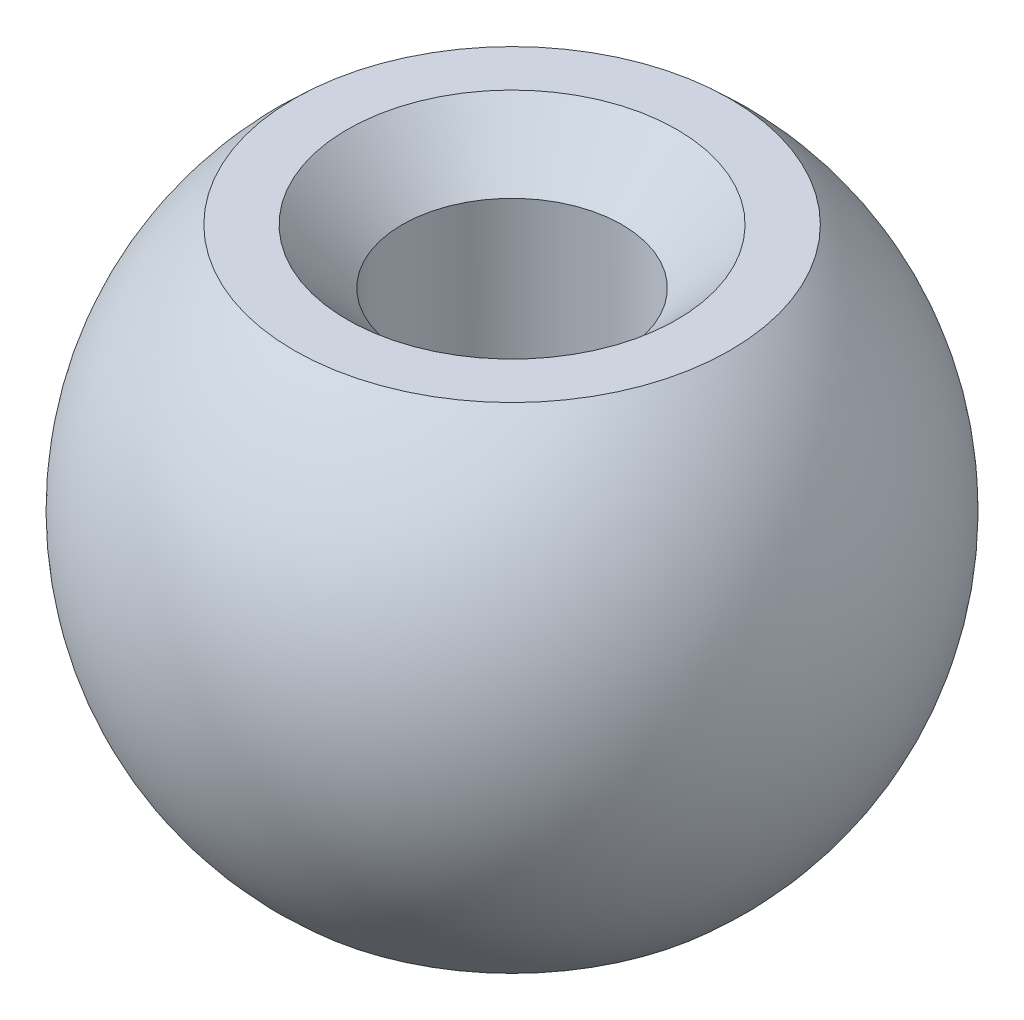
ISO-10303-21;
HEADER;
FILE_DESCRIPTION(('STEP AP214'),'2;1');
FILE_NAME('part.step','',(''),(''),'','','');
FILE_SCHEMA(('AUTOMOTIVE_DESIGN { 1 0 10303 214 1 1 1 1 }'));
ENDSEC;
DATA;
#1=APPLICATION_CONTEXT('core data for automotive mechanical design processes');
#2=APPLICATION_PROTOCOL_DEFINITION('international standard','automotive_design',2000,#1);
#3=PRODUCT_CONTEXT('',#1,'mechanical');
#4=PRODUCT('Part','Part','',(#3));
#5=PRODUCT_RELATED_PRODUCT_CATEGORY('part','',(#4));
#6=PRODUCT_DEFINITION_FORMATION('','',#4);
#7=PRODUCT_DEFINITION_CONTEXT('part definition',#1,'design');
#8=PRODUCT_DEFINITION('design','',#6,#7);
#9=PRODUCT_DEFINITION_SHAPE('','',#8);
#10=(LENGTH_UNIT() NAMED_UNIT(*) SI_UNIT(.MILLI.,.METRE.));
#11=(NAMED_UNIT(*) PLANE_ANGLE_UNIT() SI_UNIT($,.RADIAN.));
#12=(NAMED_UNIT(*) SI_UNIT($,.STERADIAN.) SOLID_ANGLE_UNIT());
#13=UNCERTAINTY_MEASURE_WITH_UNIT(LENGTH_MEASURE(1.E-05),#10,'distance_accuracy_value','');
#14=(GEOMETRIC_REPRESENTATION_CONTEXT(3) GLOBAL_UNCERTAINTY_ASSIGNED_CONTEXT((#13)) GLOBAL_UNIT_ASSIGNED_CONTEXT((#10,
#11,#12)) REPRESENTATION_CONTEXT('',''));
#15=CARTESIAN_POINT('',(0.,0.,0.));
#16=DIRECTION('',(0.,0.,1.));
#17=DIRECTION('',(1.,0.,0.));
#18=AXIS2_PLACEMENT_3D('',#15,#16,#17);
#19=CARTESIAN_POINT('',(2.,4.5,0.));
#20=DIRECTION('',(0.,-1.,0.));
#21=DIRECTION('',(0.,0.,-1.));
#22=AXIS2_PLACEMENT_3D('',#19,#20,#21);
#23=PLANE('',#22);
#24=CARTESIAN_POINT('',(0.,4.5,0.));
#25=DIRECTION('',(0.,-1.,0.));
#26=DIRECTION('',(0.,0.,-1.));
#27=AXIS2_PLACEMENT_3D('',#24,#25,#26);
#28=CIRCLE('',#27,3.);
#29=CARTESIAN_POINT('',(0.,4.5,-3.));
#30=VERTEX_POINT('',#29);
#31=EDGE_CURVE('E12',#30,#30,#28,.T.);
#32=ORIENTED_EDGE('',*,*,#31,.T.);
#33=EDGE_LOOP('',(#32));
#34=FACE_BOUND('',#33,.T.);
#35=CARTESIAN_POINT('',(0.,4.5,0.));
#36=DIRECTION('',(0.,1.,0.));
#37=DIRECTION('',(0.,0.,1.));
#38=AXIS2_PLACEMENT_3D('',#35,#36,#37);
#39=CIRCLE('',#38,3.96862696659689);
#40=CARTESIAN_POINT('',(0.,4.5,3.96862696659689));
#41=VERTEX_POINT('',#40);
#42=EDGE_CURVE('E62',#41,#41,#39,.T.);
#43=ORIENTED_EDGE('',*,*,#42,.T.);
#44=EDGE_LOOP('',(#43));
#45=FACE_BOUND('',#44,.T.);
#46=ADVANCED_FACE('F42',(#34,#45),#23,.F.);
#47=CARTESIAN_POINT('',(0.,5.53448264102485,0.));
#48=DIRECTION('',(0.,1.,0.));
#49=DIRECTION('',(0.,0.,1.));
#50=AXIS2_PLACEMENT_3D('',#47,#48,#49);
#51=CYLINDRICAL_SURFACE('',#50,2.);
#52=CARTESIAN_POINT('',(0.,3.5,0.));
#53=DIRECTION('',(0.,-1.,0.));
#54=DIRECTION('',(0.,0.,-1.));
#55=AXIS2_PLACEMENT_3D('',#52,#53,#54);
#56=CIRCLE('',#55,2.);
#57=CARTESIAN_POINT('',(0.,3.5,-2.));
#58=VERTEX_POINT('',#57);
#59=EDGE_CURVE('E49',#58,#58,#56,.F.);
#60=ORIENTED_EDGE('',*,*,#59,.T.);
#61=EDGE_LOOP('',(#60));
#62=FACE_BOUND('',#61,.T.);
#63=CARTESIAN_POINT('',(0.,-4.5,0.));
#64=DIRECTION('',(0.,1.,0.));
#65=DIRECTION('',(0.,0.,1.));
#66=AXIS2_PLACEMENT_3D('',#63,#64,#65);
#67=CIRCLE('',#66,2.);
#68=CARTESIAN_POINT('',(0.,-4.5,2.));
#69=VERTEX_POINT('',#68);
#70=EDGE_CURVE('E53',#69,#69,#67,.T.);
#71=ORIENTED_EDGE('',*,*,#70,.F.);
#72=EDGE_LOOP('',(#71));
#73=FACE_BOUND('',#72,.T.);
#74=ADVANCED_FACE('F76',(#62,#73),#51,.F.);
#75=CARTESIAN_POINT('',(2.,-4.5,0.));
#76=DIRECTION('',(0.,1.,0.));
#77=DIRECTION('',(0.,0.,1.));
#78=AXIS2_PLACEMENT_3D('',#75,#76,#77);
#79=PLANE('',#78);
#80=CARTESIAN_POINT('',(0.,-4.5,0.));
#81=DIRECTION('',(0.,1.,0.));
#82=DIRECTION('',(0.,0.,1.));
#83=AXIS2_PLACEMENT_3D('',#80,#81,#82);
#84=CIRCLE('',#83,3.96862696659688);
#85=CARTESIAN_POINT('',(0.,-4.5,3.96862696659688));
#86=VERTEX_POINT('',#85);
#87=EDGE_CURVE('E57',#86,#86,#84,.T.);
#88=ORIENTED_EDGE('',*,*,#87,.F.);
#89=EDGE_LOOP('',(#88));
#90=FACE_BOUND('',#89,.T.);
#91=ORIENTED_EDGE('',*,*,#70,.T.);
#92=EDGE_LOOP('',(#91));
#93=FACE_BOUND('',#92,.T.);
#94=ADVANCED_FACE('F70',(#90,#93),#79,.F.);
#95=CARTESIAN_POINT('',(0.,0.,0.));
#96=DIRECTION('',(0.,1.,0.));
#97=DIRECTION('',(1.,0.,0.));
#98=AXIS2_PLACEMENT_3D('',#95,#96,#97);
#99=SPHERICAL_SURFACE('',#98,6.);
#100=ORIENTED_EDGE('',*,*,#42,.F.);
#101=EDGE_LOOP('',(#100));
#102=FACE_BOUND('',#101,.T.);
#103=ORIENTED_EDGE('',*,*,#87,.T.);
#104=EDGE_LOOP('',(#103));
#105=FACE_BOUND('',#104,.T.);
#106=ADVANCED_FACE('F67',(#102,#105),#99,.T.);
#107=CARTESIAN_POINT('',(0.,3.5,0.));
#108=DIRECTION('',(0.,1.,0.));
#109=DIRECTION('',(0.,0.,1.));
#110=AXIS2_PLACEMENT_3D('',#107,#108,#109);
#111=CONICAL_SURFACE('',#110,2.,0.785398163397451);
#112=ORIENTED_EDGE('',*,*,#31,.F.);
#113=EDGE_LOOP('',(#112));
#114=FACE_BOUND('',#113,.T.);
#115=ORIENTED_EDGE('',*,*,#59,.F.);
#116=EDGE_LOOP('',(#115));
#117=FACE_BOUND('',#116,.T.);
#118=ADVANCED_FACE('F44',(#114,#117),#111,.F.);
#119=CLOSED_SHELL('',(#46,#74,#94,#106,#118));
#120=MANIFOLD_SOLID_BREP('B2',#119);
#121=ADVANCED_BREP_SHAPE_REPRESENTATION('',(#18,#120),#14);
#122=SHAPE_DEFINITION_REPRESENTATION(#9,#121);
ENDSEC;
END-ISO-10303-21;
